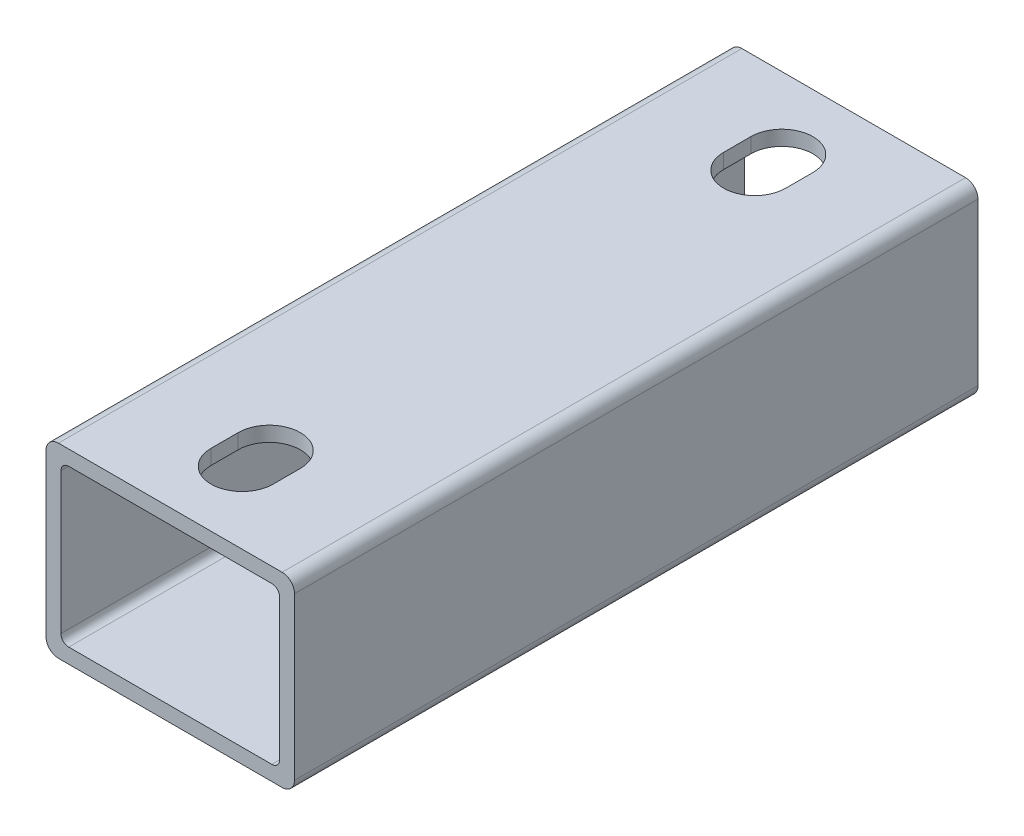
ISO-10303-21;
HEADER;
FILE_DESCRIPTION(('STEP AP214'),'2;1');
FILE_NAME('part.step','',(''),(''),'','','');
FILE_SCHEMA(('AUTOMOTIVE_DESIGN { 1 0 10303 214 1 1 1 1 }'));
ENDSEC;
DATA;
#1=APPLICATION_CONTEXT('core data for automotive mechanical design processes');
#2=APPLICATION_PROTOCOL_DEFINITION('international standard','automotive_design',2000,#1);
#3=PRODUCT_CONTEXT('',#1,'mechanical');
#4=PRODUCT('Part','Part','',(#3));
#5=PRODUCT_RELATED_PRODUCT_CATEGORY('part','',(#4));
#6=PRODUCT_DEFINITION_FORMATION('','',#4);
#7=PRODUCT_DEFINITION_CONTEXT('part definition',#1,'design');
#8=PRODUCT_DEFINITION('design','',#6,#7);
#9=PRODUCT_DEFINITION_SHAPE('','',#8);
#10=(LENGTH_UNIT() NAMED_UNIT(*) SI_UNIT(.MILLI.,.METRE.));
#11=(NAMED_UNIT(*) PLANE_ANGLE_UNIT() SI_UNIT($,.RADIAN.));
#12=(NAMED_UNIT(*) SI_UNIT($,.STERADIAN.) SOLID_ANGLE_UNIT());
#13=UNCERTAINTY_MEASURE_WITH_UNIT(LENGTH_MEASURE(1.E-05),#10,'distance_accuracy_value','');
#14=(GEOMETRIC_REPRESENTATION_CONTEXT(3) GLOBAL_UNCERTAINTY_ASSIGNED_CONTEXT((#13)) GLOBAL_UNIT_ASSIGNED_CONTEXT((#10,
#11,#12)) REPRESENTATION_CONTEXT('',''));
#15=CARTESIAN_POINT('',(0.,0.,0.));
#16=DIRECTION('',(0.,0.,1.));
#17=DIRECTION('',(1.,0.,0.));
#18=AXIS2_PLACEMENT_3D('',#15,#16,#17);
#19=CARTESIAN_POINT('',(22.86,-16.51,139.7));
#20=DIRECTION('',(0.,0.,1.));
#21=DIRECTION('',(1.,0.,0.));
#22=AXIS2_PLACEMENT_3D('',#19,#20,#21);
#23=PLANE('',#22);
#24=CARTESIAN_POINT('',(22.86,-16.51,139.7));
#25=DIRECTION('',(0.,0.,1.));
#26=DIRECTION('',(1.,0.,0.));
#27=AXIS2_PLACEMENT_3D('',#24,#25,#26);
#28=CIRCLE('',#27,2.53999999999999);
#29=CARTESIAN_POINT('',(22.86,-19.05,139.7));
#30=VERTEX_POINT('',#29);
#31=CARTESIAN_POINT('',(25.4,-16.51,139.7));
#32=VERTEX_POINT('',#31);
#33=EDGE_CURVE('E325',#30,#32,#28,.T.);
#34=ORIENTED_EDGE('',*,*,#33,.T.);
#35=DIRECTION('',(0.,1.,0.));
#36=VECTOR('',#35,1.);
#37=CARTESIAN_POINT('',(25.4,-16.51,139.7));
#38=LINE('',#37,#36);
#39=CARTESIAN_POINT('',(25.4,16.51,139.7));
#40=VERTEX_POINT('',#39);
#41=EDGE_CURVE('E328',#32,#40,#38,.T.);
#42=ORIENTED_EDGE('',*,*,#41,.T.);
#43=CARTESIAN_POINT('',(22.86,16.51,139.7));
#44=DIRECTION('',(0.,0.,1.));
#45=DIRECTION('',(1.,0.,0.));
#46=AXIS2_PLACEMENT_3D('',#43,#44,#45);
#47=CIRCLE('',#46,2.54);
#48=CARTESIAN_POINT('',(22.86,19.05,139.7));
#49=VERTEX_POINT('',#48);
#50=EDGE_CURVE('E331',#40,#49,#47,.T.);
#51=ORIENTED_EDGE('',*,*,#50,.T.);
#52=DIRECTION('',(-1.,0.,0.));
#53=VECTOR('',#52,1.);
#54=CARTESIAN_POINT('',(22.86,19.05,139.7));
#55=LINE('',#54,#53);
#56=CARTESIAN_POINT('',(-22.86,19.05,139.7));
#57=VERTEX_POINT('',#56);
#58=EDGE_CURVE('E333',#49,#57,#55,.T.);
#59=ORIENTED_EDGE('',*,*,#58,.T.);
#60=CARTESIAN_POINT('',(-22.86,16.51,139.7));
#61=DIRECTION('',(0.,0.,1.));
#62=DIRECTION('',(1.,0.,0.));
#63=AXIS2_PLACEMENT_3D('',#60,#61,#62);
#64=CIRCLE('',#63,2.54);
#65=CARTESIAN_POINT('',(-25.4,16.51,139.7));
#66=VERTEX_POINT('',#65);
#67=EDGE_CURVE('E335',#57,#66,#64,.T.);
#68=ORIENTED_EDGE('',*,*,#67,.T.);
#69=DIRECTION('',(0.,-1.,0.));
#70=VECTOR('',#69,1.);
#71=CARTESIAN_POINT('',(-25.4,-16.51,139.7));
#72=LINE('',#71,#70);
#73=CARTESIAN_POINT('',(-25.4,-16.51,139.7));
#74=VERTEX_POINT('',#73);
#75=EDGE_CURVE('E337',#66,#74,#72,.T.);
#76=ORIENTED_EDGE('',*,*,#75,.T.);
#77=CARTESIAN_POINT('',(-22.86,-16.51,139.7));
#78=DIRECTION('',(0.,0.,1.));
#79=DIRECTION('',(1.,0.,0.));
#80=AXIS2_PLACEMENT_3D('',#77,#78,#79);
#81=CIRCLE('',#80,2.54);
#82=CARTESIAN_POINT('',(-22.86,-19.05,139.7));
#83=VERTEX_POINT('',#82);
#84=EDGE_CURVE('E339',#74,#83,#81,.T.);
#85=ORIENTED_EDGE('',*,*,#84,.T.);
#86=DIRECTION('',(1.,0.,0.));
#87=VECTOR('',#86,1.);
#88=CARTESIAN_POINT('',(22.86,-19.05,139.7));
#89=LINE('',#88,#87);
#90=EDGE_CURVE('E341',#83,#30,#89,.T.);
#91=ORIENTED_EDGE('',*,*,#90,.T.);
#92=EDGE_LOOP('',(#34,#42,#51,#59,#68,#76,#85,#91));
#93=FACE_BOUND('',#92,.T.);
#94=DIRECTION('',(-1.,0.,0.));
#95=VECTOR('',#94,1.);
#96=CARTESIAN_POINT('',(20.7518,16.002,139.7));
#97=LINE('',#96,#95);
#98=CARTESIAN_POINT('',(20.7518,16.002,139.7));
#99=VERTEX_POINT('',#98);
#100=CARTESIAN_POINT('',(-20.7518,16.002,139.7));
#101=VERTEX_POINT('',#100);
#102=EDGE_CURVE('E268',#99,#101,#97,.T.);
#103=ORIENTED_EDGE('',*,*,#102,.F.);
#104=CARTESIAN_POINT('',(20.7518,14.4018,139.7));
#105=DIRECTION('',(0.,0.,1.));
#106=DIRECTION('',(1.,0.,0.));
#107=AXIS2_PLACEMENT_3D('',#104,#105,#106);
#108=CIRCLE('',#107,1.6002);
#109=CARTESIAN_POINT('',(22.352,14.4018,139.7));
#110=VERTEX_POINT('',#109);
#111=EDGE_CURVE('E266',#110,#99,#108,.T.);
#112=ORIENTED_EDGE('',*,*,#111,.F.);
#113=DIRECTION('',(0.,1.,0.));
#114=VECTOR('',#113,1.);
#115=CARTESIAN_POINT('',(22.352,14.4018,139.7));
#116=LINE('',#115,#114);
#117=CARTESIAN_POINT('',(22.352,-14.4018,139.7));
#118=VERTEX_POINT('',#117);
#119=EDGE_CURVE('E282',#118,#110,#116,.T.);
#120=ORIENTED_EDGE('',*,*,#119,.F.);
#121=CARTESIAN_POINT('',(20.7518,-14.4018,139.7));
#122=DIRECTION('',(0.,0.,1.));
#123=DIRECTION('',(1.,0.,0.));
#124=AXIS2_PLACEMENT_3D('',#121,#122,#123);
#125=CIRCLE('',#124,1.6002);
#126=CARTESIAN_POINT('',(20.7518,-16.002,139.7));
#127=VERTEX_POINT('',#126);
#128=EDGE_CURVE('E279',#127,#118,#125,.T.);
#129=ORIENTED_EDGE('',*,*,#128,.F.);
#130=DIRECTION('',(1.,0.,0.));
#131=VECTOR('',#130,1.);
#132=CARTESIAN_POINT('',(20.7518,-16.002,139.7));
#133=LINE('',#132,#131);
#134=CARTESIAN_POINT('',(-20.7518,-16.002,139.7));
#135=VERTEX_POINT('',#134);
#136=EDGE_CURVE('E277',#135,#127,#133,.T.);
#137=ORIENTED_EDGE('',*,*,#136,.F.);
#138=CARTESIAN_POINT('',(-20.7518,-14.4018,139.7));
#139=DIRECTION('',(0.,0.,1.));
#140=DIRECTION('',(1.,0.,0.));
#141=AXIS2_PLACEMENT_3D('',#138,#139,#140);
#142=CIRCLE('',#141,1.6002);
#143=CARTESIAN_POINT('',(-22.352,-14.4018,139.7));
#144=VERTEX_POINT('',#143);
#145=EDGE_CURVE('E275',#144,#135,#142,.T.);
#146=ORIENTED_EDGE('',*,*,#145,.F.);
#147=DIRECTION('',(0.,-1.,0.));
#148=VECTOR('',#147,1.);
#149=CARTESIAN_POINT('',(-22.352,14.4018,139.7));
#150=LINE('',#149,#148);
#151=CARTESIAN_POINT('',(-22.352,14.4018,139.7));
#152=VERTEX_POINT('',#151);
#153=EDGE_CURVE('E273',#152,#144,#150,.T.);
#154=ORIENTED_EDGE('',*,*,#153,.F.);
#155=CARTESIAN_POINT('',(-20.7518,14.4018,139.7));
#156=DIRECTION('',(0.,0.,1.));
#157=DIRECTION('',(1.,0.,0.));
#158=AXIS2_PLACEMENT_3D('',#155,#156,#157);
#159=CIRCLE('',#158,1.6002);
#160=EDGE_CURVE('E271',#101,#152,#159,.T.);
#161=ORIENTED_EDGE('',*,*,#160,.F.);
#162=EDGE_LOOP('',(#103,#112,#120,#129,#137,#146,#154,#161));
#163=FACE_BOUND('',#162,.T.);
#164=ADVANCED_FACE('F35',(#93,#163),#23,.T.);
#165=CARTESIAN_POINT('',(22.86,-16.51,0.));
#166=DIRECTION('',(0.,0.,1.));
#167=DIRECTION('',(1.,0.,0.));
#168=AXIS2_PLACEMENT_3D('',#165,#166,#167);
#169=PLANE('',#168);
#170=CARTESIAN_POINT('',(22.86,-16.51,0.));
#171=DIRECTION('',(0.,0.,1.));
#172=DIRECTION('',(1.,0.,0.));
#173=AXIS2_PLACEMENT_3D('',#170,#171,#172);
#174=CIRCLE('',#173,2.53999999999999);
#175=CARTESIAN_POINT('',(22.86,-19.05,0.));
#176=VERTEX_POINT('',#175);
#177=CARTESIAN_POINT('',(25.4,-16.51,0.));
#178=VERTEX_POINT('',#177);
#179=EDGE_CURVE('E324',#176,#178,#174,.T.);
#180=ORIENTED_EDGE('',*,*,#179,.F.);
#181=DIRECTION('',(1.,0.,0.));
#182=VECTOR('',#181,1.);
#183=CARTESIAN_POINT('',(22.86,-19.05,0.));
#184=LINE('',#183,#182);
#185=CARTESIAN_POINT('',(-22.86,-19.05,0.));
#186=VERTEX_POINT('',#185);
#187=EDGE_CURVE('E329',#186,#176,#184,.T.);
#188=ORIENTED_EDGE('',*,*,#187,.F.);
#189=CARTESIAN_POINT('',(-22.86,-16.51,0.));
#190=DIRECTION('',(0.,0.,1.));
#191=DIRECTION('',(1.,0.,0.));
#192=AXIS2_PLACEMENT_3D('',#189,#190,#191);
#193=CIRCLE('',#192,2.54);
#194=CARTESIAN_POINT('',(-25.4,-16.51,0.));
#195=VERTEX_POINT('',#194);
#196=EDGE_CURVE('E356',#195,#186,#193,.T.);
#197=ORIENTED_EDGE('',*,*,#196,.F.);
#198=DIRECTION('',(0.,-1.,0.));
#199=VECTOR('',#198,1.);
#200=CARTESIAN_POINT('',(-25.4,-16.51,0.));
#201=LINE('',#200,#199);
#202=CARTESIAN_POINT('',(-25.4,16.51,0.));
#203=VERTEX_POINT('',#202);
#204=EDGE_CURVE('E354',#203,#195,#201,.T.);
#205=ORIENTED_EDGE('',*,*,#204,.F.);
#206=CARTESIAN_POINT('',(-22.86,16.51,0.));
#207=DIRECTION('',(0.,0.,1.));
#208=DIRECTION('',(1.,0.,0.));
#209=AXIS2_PLACEMENT_3D('',#206,#207,#208);
#210=CIRCLE('',#209,2.54);
#211=CARTESIAN_POINT('',(-22.86,19.05,0.));
#212=VERTEX_POINT('',#211);
#213=EDGE_CURVE('E352',#212,#203,#210,.T.);
#214=ORIENTED_EDGE('',*,*,#213,.F.);
#215=DIRECTION('',(-1.,0.,0.));
#216=VECTOR('',#215,1.);
#217=CARTESIAN_POINT('',(22.86,19.05,0.));
#218=LINE('',#217,#216);
#219=CARTESIAN_POINT('',(22.86,19.05,0.));
#220=VERTEX_POINT('',#219);
#221=EDGE_CURVE('E350',#220,#212,#218,.T.);
#222=ORIENTED_EDGE('',*,*,#221,.F.);
#223=CARTESIAN_POINT('',(22.86,16.51,0.));
#224=DIRECTION('',(0.,0.,1.));
#225=DIRECTION('',(1.,0.,0.));
#226=AXIS2_PLACEMENT_3D('',#223,#224,#225);
#227=CIRCLE('',#226,2.54);
#228=CARTESIAN_POINT('',(25.4,16.51,0.));
#229=VERTEX_POINT('',#228);
#230=EDGE_CURVE('E348',#229,#220,#227,.T.);
#231=ORIENTED_EDGE('',*,*,#230,.F.);
#232=DIRECTION('',(0.,1.,0.));
#233=VECTOR('',#232,1.);
#234=CARTESIAN_POINT('',(25.4,-16.51,0.));
#235=LINE('',#234,#233);
#236=EDGE_CURVE('E346',#178,#229,#235,.T.);
#237=ORIENTED_EDGE('',*,*,#236,.F.);
#238=EDGE_LOOP('',(#180,#188,#197,#205,#214,#222,#231,#237));
#239=FACE_BOUND('',#238,.T.);
#240=CARTESIAN_POINT('',(20.7518,14.4018,0.));
#241=DIRECTION('',(0.,0.,1.));
#242=DIRECTION('',(1.,0.,0.));
#243=AXIS2_PLACEMENT_3D('',#240,#241,#242);
#244=CIRCLE('',#243,1.6002);
#245=CARTESIAN_POINT('',(22.352,14.4018,0.));
#246=VERTEX_POINT('',#245);
#247=CARTESIAN_POINT('',(20.7518,16.002,0.));
#248=VERTEX_POINT('',#247);
#249=EDGE_CURVE('E214',#246,#248,#244,.T.);
#250=ORIENTED_EDGE('',*,*,#249,.T.);
#251=DIRECTION('',(-1.,0.,0.));
#252=VECTOR('',#251,1.);
#253=CARTESIAN_POINT('',(20.7518,16.002,0.));
#254=LINE('',#253,#252);
#255=CARTESIAN_POINT('',(-20.7518,16.002,0.));
#256=VERTEX_POINT('',#255);
#257=EDGE_CURVE('E287',#248,#256,#254,.T.);
#258=ORIENTED_EDGE('',*,*,#257,.T.);
#259=CARTESIAN_POINT('',(-20.7518,14.4018,0.));
#260=DIRECTION('',(0.,0.,1.));
#261=DIRECTION('',(1.,0.,0.));
#262=AXIS2_PLACEMENT_3D('',#259,#260,#261);
#263=CIRCLE('',#262,1.6002);
#264=CARTESIAN_POINT('',(-22.352,14.4018,0.));
#265=VERTEX_POINT('',#264);
#266=EDGE_CURVE('E290',#256,#265,#263,.T.);
#267=ORIENTED_EDGE('',*,*,#266,.T.);
#268=DIRECTION('',(0.,-1.,0.));
#269=VECTOR('',#268,1.);
#270=CARTESIAN_POINT('',(-22.352,14.4018,0.));
#271=LINE('',#270,#269);
#272=CARTESIAN_POINT('',(-22.352,-14.4018,0.));
#273=VERTEX_POINT('',#272);
#274=EDGE_CURVE('E293',#265,#273,#271,.T.);
#275=ORIENTED_EDGE('',*,*,#274,.T.);
#276=CARTESIAN_POINT('',(-20.7518,-14.4018,0.));
#277=DIRECTION('',(0.,0.,1.));
#278=DIRECTION('',(1.,0.,0.));
#279=AXIS2_PLACEMENT_3D('',#276,#277,#278);
#280=CIRCLE('',#279,1.6002);
#281=CARTESIAN_POINT('',(-20.7518,-16.002,0.));
#282=VERTEX_POINT('',#281);
#283=EDGE_CURVE('E296',#273,#282,#280,.T.);
#284=ORIENTED_EDGE('',*,*,#283,.T.);
#285=DIRECTION('',(1.,0.,0.));
#286=VECTOR('',#285,1.);
#287=CARTESIAN_POINT('',(20.7518,-16.002,0.));
#288=LINE('',#287,#286);
#289=CARTESIAN_POINT('',(20.7518,-16.002,0.));
#290=VERTEX_POINT('',#289);
#291=EDGE_CURVE('E299',#282,#290,#288,.T.);
#292=ORIENTED_EDGE('',*,*,#291,.T.);
#293=CARTESIAN_POINT('',(20.7518,-14.4018,0.));
#294=DIRECTION('',(0.,0.,1.));
#295=DIRECTION('',(1.,0.,0.));
#296=AXIS2_PLACEMENT_3D('',#293,#294,#295);
#297=CIRCLE('',#296,1.6002);
#298=CARTESIAN_POINT('',(22.352,-14.4018,0.));
#299=VERTEX_POINT('',#298);
#300=EDGE_CURVE('E302',#290,#299,#297,.T.);
#301=ORIENTED_EDGE('',*,*,#300,.T.);
#302=DIRECTION('',(0.,1.,0.));
#303=VECTOR('',#302,1.);
#304=CARTESIAN_POINT('',(22.352,14.4018,0.));
#305=LINE('',#304,#303);
#306=EDGE_CURVE('E269',#299,#246,#305,.T.);
#307=ORIENTED_EDGE('',*,*,#306,.T.);
#308=EDGE_LOOP('',(#250,#258,#267,#275,#284,#292,#301,#307));
#309=FACE_BOUND('',#308,.T.);
#310=ADVANCED_FACE('F386',(#239,#309),#169,.F.);
#311=CARTESIAN_POINT('',(22.86,-16.51,139.7));
#312=DIRECTION('',(0.,0.,-1.));
#313=DIRECTION('',(-1.,0.,0.));
#314=AXIS2_PLACEMENT_3D('',#311,#312,#313);
#315=CYLINDRICAL_SURFACE('',#314,2.53999999999999);
#316=ORIENTED_EDGE('',*,*,#179,.T.);
#317=DIRECTION('',(0.,0.,-1.));
#318=VECTOR('',#317,1.);
#319=CARTESIAN_POINT('',(25.4,-16.51,139.7));
#320=LINE('',#319,#318);
#321=EDGE_CURVE('E11',#32,#178,#320,.T.);
#322=ORIENTED_EDGE('',*,*,#321,.F.);
#323=ORIENTED_EDGE('',*,*,#33,.F.);
#324=DIRECTION('',(0.,0.,-1.));
#325=VECTOR('',#324,1.);
#326=CARTESIAN_POINT('',(22.86,-19.05,139.7));
#327=LINE('',#326,#325);
#328=EDGE_CURVE('E343',#30,#176,#327,.T.);
#329=ORIENTED_EDGE('',*,*,#328,.T.);
#330=EDGE_LOOP('',(#316,#322,#323,#329));
#331=FACE_BOUND('',#330,.T.);
#332=ADVANCED_FACE('F37',(#331),#315,.T.);
#333=CARTESIAN_POINT('',(25.4,-16.51,139.7));
#334=DIRECTION('',(-1.,0.,0.));
#335=DIRECTION('',(0.,0.,1.));
#336=AXIS2_PLACEMENT_3D('',#333,#334,#335);
#337=PLANE('',#336);
#338=ORIENTED_EDGE('',*,*,#236,.T.);
#339=DIRECTION('',(0.,0.,-1.));
#340=VECTOR('',#339,1.);
#341=CARTESIAN_POINT('',(25.4,16.51,139.7));
#342=LINE('',#341,#340);
#343=EDGE_CURVE('E43',#40,#229,#342,.T.);
#344=ORIENTED_EDGE('',*,*,#343,.F.);
#345=ORIENTED_EDGE('',*,*,#41,.F.);
#346=ORIENTED_EDGE('',*,*,#321,.T.);
#347=EDGE_LOOP('',(#338,#344,#345,#346));
#348=FACE_BOUND('',#347,.T.);
#349=ADVANCED_FACE('F403',(#348),#337,.F.);
#350=CARTESIAN_POINT('',(22.86,16.51,139.7));
#351=DIRECTION('',(0.,0.,-1.));
#352=DIRECTION('',(-1.,0.,0.));
#353=AXIS2_PLACEMENT_3D('',#350,#351,#352);
#354=CYLINDRICAL_SURFACE('',#353,2.54);
#355=ORIENTED_EDGE('',*,*,#230,.T.);
#356=DIRECTION('',(0.,0.,-1.));
#357=VECTOR('',#356,1.);
#358=CARTESIAN_POINT('',(22.86,19.05,139.7));
#359=LINE('',#358,#357);
#360=EDGE_CURVE('E373',#49,#220,#359,.T.);
#361=ORIENTED_EDGE('',*,*,#360,.F.);
#362=ORIENTED_EDGE('',*,*,#50,.F.);
#363=ORIENTED_EDGE('',*,*,#343,.T.);
#364=EDGE_LOOP('',(#355,#361,#362,#363));
#365=FACE_BOUND('',#364,.T.);
#366=ADVANCED_FACE('F380',(#365),#354,.T.);
#367=CARTESIAN_POINT('',(22.86,19.05,139.7));
#368=DIRECTION('',(0.,-1.,0.));
#369=DIRECTION('',(0.,0.,-1.));
#370=AXIS2_PLACEMENT_3D('',#367,#368,#369);
#371=PLANE('',#370);
#372=DIRECTION('',(0.,0.,1.));
#373=VECTOR('',#372,1.);
#374=CARTESIAN_POINT('',(-6.35000000000006,19.05,20.2406250000001));
#375=LINE('',#374,#373);
#376=CARTESIAN_POINT('',(-6.35000000000006,19.05,14.6843750000001));
#377=VERTEX_POINT('',#376);
#378=CARTESIAN_POINT('',(-6.35,19.05,20.2406250000001));
#379=VERTEX_POINT('',#378);
#380=EDGE_CURVE('E221',#377,#379,#375,.T.);
#381=ORIENTED_EDGE('',*,*,#380,.F.);
#382=CARTESIAN_POINT('',(0.,19.05,14.6843750000001));
#383=DIRECTION('',(0.,1.,0.));
#384=DIRECTION('',(0.,0.,1.));
#385=AXIS2_PLACEMENT_3D('',#382,#383,#384);
#386=CIRCLE('',#385,6.35000000000007);
#387=CARTESIAN_POINT('',(6.35000000000009,19.05,14.6843750000001));
#388=VERTEX_POINT('',#387);
#389=EDGE_CURVE('E50',#388,#377,#386,.T.);
#390=ORIENTED_EDGE('',*,*,#389,.F.);
#391=DIRECTION('',(0.,0.,-1.));
#392=VECTOR('',#391,1.);
#393=CARTESIAN_POINT('',(6.35000000000009,19.05,14.6843750000001));
#394=LINE('',#393,#392);
#395=CARTESIAN_POINT('',(6.35000000000004,19.05,20.2406250000001));
#396=VERTEX_POINT('',#395);
#397=EDGE_CURVE('E207',#396,#388,#394,.T.);
#398=ORIENTED_EDGE('',*,*,#397,.F.);
#399=CARTESIAN_POINT('',(0.,19.05,20.2406250000001));
#400=DIRECTION('',(0.,1.,0.));
#401=DIRECTION('',(0.,0.,1.));
#402=AXIS2_PLACEMENT_3D('',#399,#400,#401);
#403=CIRCLE('',#402,6.35000000000005);
#404=EDGE_CURVE('E215',#379,#396,#403,.T.);
#405=ORIENTED_EDGE('',*,*,#404,.F.);
#406=EDGE_LOOP('',(#381,#390,#398,#405));
#407=FACE_BOUND('',#406,.T.);
#408=DIRECTION('',(0.,0.,-1.));
#409=VECTOR('',#408,1.);
#410=CARTESIAN_POINT('',(6.3500000000001,19.05,119.459375));
#411=LINE('',#410,#409);
#412=CARTESIAN_POINT('',(6.35000000000005,19.05,125.015625));
#413=VERTEX_POINT('',#412);
#414=CARTESIAN_POINT('',(6.35000000000013,19.05,119.459375));
#415=VERTEX_POINT('',#414);
#416=EDGE_CURVE('E247',#413,#415,#411,.T.);
#417=ORIENTED_EDGE('',*,*,#416,.F.);
#418=CARTESIAN_POINT('',(0.,19.05,125.015625));
#419=DIRECTION('',(0.,1.,0.));
#420=DIRECTION('',(0.,0.,1.));
#421=AXIS2_PLACEMENT_3D('',#418,#419,#420);
#422=CIRCLE('',#421,6.35000000000005);
#423=CARTESIAN_POINT('',(-6.35000000000004,19.05,125.015625));
#424=VERTEX_POINT('',#423);
#425=EDGE_CURVE('E58',#424,#413,#422,.T.);
#426=ORIENTED_EDGE('',*,*,#425,.F.);
#427=DIRECTION('',(0.,0.,1.));
#428=VECTOR('',#427,1.);
#429=CARTESIAN_POINT('',(-6.35000000000004,19.05,125.015625));
#430=LINE('',#429,#428);
#431=CARTESIAN_POINT('',(-6.35000000000004,19.05,119.459375));
#432=VERTEX_POINT('',#431);
#433=EDGE_CURVE('E231',#432,#424,#430,.T.);
#434=ORIENTED_EDGE('',*,*,#433,.F.);
#435=CARTESIAN_POINT('',(0.,19.05,119.459375));
#436=DIRECTION('',(0.,1.,0.));
#437=DIRECTION('',(0.,0.,1.));
#438=AXIS2_PLACEMENT_3D('',#435,#436,#437);
#439=CIRCLE('',#438,6.35000000000007);
#440=EDGE_CURVE('E244',#415,#432,#439,.T.);
#441=ORIENTED_EDGE('',*,*,#440,.F.);
#442=EDGE_LOOP('',(#417,#426,#434,#441));
#443=FACE_BOUND('',#442,.T.);
#444=ORIENTED_EDGE('',*,*,#221,.T.);
#445=DIRECTION('',(0.,0.,-1.));
#446=VECTOR('',#445,1.);
#447=CARTESIAN_POINT('',(-22.86,19.05,139.7));
#448=LINE('',#447,#446);
#449=EDGE_CURVE('E370',#57,#212,#448,.T.);
#450=ORIENTED_EDGE('',*,*,#449,.F.);
#451=ORIENTED_EDGE('',*,*,#58,.F.);
#452=ORIENTED_EDGE('',*,*,#360,.T.);
#453=EDGE_LOOP('',(#444,#450,#451,#452));
#454=FACE_BOUND('',#453,.T.);
#455=ADVANCED_FACE('F218',(#407,#443,#454),#371,.F.);
#456=CARTESIAN_POINT('',(-22.86,16.51,139.7));
#457=DIRECTION('',(0.,0.,-1.));
#458=DIRECTION('',(-1.,0.,0.));
#459=AXIS2_PLACEMENT_3D('',#456,#457,#458);
#460=CYLINDRICAL_SURFACE('',#459,2.54);
#461=ORIENTED_EDGE('',*,*,#213,.T.);
#462=DIRECTION('',(0.,0.,-1.));
#463=VECTOR('',#462,1.);
#464=CARTESIAN_POINT('',(-25.4,16.51,139.7));
#465=LINE('',#464,#463);
#466=EDGE_CURVE('E367',#66,#203,#465,.T.);
#467=ORIENTED_EDGE('',*,*,#466,.F.);
#468=ORIENTED_EDGE('',*,*,#67,.F.);
#469=ORIENTED_EDGE('',*,*,#449,.T.);
#470=EDGE_LOOP('',(#461,#467,#468,#469));
#471=FACE_BOUND('',#470,.T.);
#472=ADVANCED_FACE('F395',(#471),#460,.T.);
#473=CARTESIAN_POINT('',(-25.4,-16.51,139.7));
#474=DIRECTION('',(1.,0.,0.));
#475=DIRECTION('',(0.,1.,0.));
#476=AXIS2_PLACEMENT_3D('',#473,#474,#475);
#477=PLANE('',#476);
#478=ORIENTED_EDGE('',*,*,#204,.T.);
#479=DIRECTION('',(0.,0.,-1.));
#480=VECTOR('',#479,1.);
#481=CARTESIAN_POINT('',(-25.4,-16.51,139.7));
#482=LINE('',#481,#480);
#483=EDGE_CURVE('E364',#74,#195,#482,.T.);
#484=ORIENTED_EDGE('',*,*,#483,.F.);
#485=ORIENTED_EDGE('',*,*,#75,.F.);
#486=ORIENTED_EDGE('',*,*,#466,.T.);
#487=EDGE_LOOP('',(#478,#484,#485,#486));
#488=FACE_BOUND('',#487,.T.);
#489=ADVANCED_FACE('F416',(#488),#477,.F.);
#490=CARTESIAN_POINT('',(-22.86,-16.51,139.7));
#491=DIRECTION('',(0.,0.,-1.));
#492=DIRECTION('',(-1.,0.,0.));
#493=AXIS2_PLACEMENT_3D('',#490,#491,#492);
#494=CYLINDRICAL_SURFACE('',#493,2.54);
#495=ORIENTED_EDGE('',*,*,#196,.T.);
#496=DIRECTION('',(0.,0.,-1.));
#497=VECTOR('',#496,1.);
#498=CARTESIAN_POINT('',(-22.86,-19.05,139.7));
#499=LINE('',#498,#497);
#500=EDGE_CURVE('E361',#83,#186,#499,.T.);
#501=ORIENTED_EDGE('',*,*,#500,.F.);
#502=ORIENTED_EDGE('',*,*,#84,.F.);
#503=ORIENTED_EDGE('',*,*,#483,.T.);
#504=EDGE_LOOP('',(#495,#501,#502,#503));
#505=FACE_BOUND('',#504,.T.);
#506=ADVANCED_FACE('F414',(#505),#494,.T.);
#507=CARTESIAN_POINT('',(22.86,-19.05,139.7));
#508=DIRECTION('',(0.,1.,0.));
#509=DIRECTION('',(-1.,0.,0.));
#510=AXIS2_PLACEMENT_3D('',#507,#508,#509);
#511=PLANE('',#510);
#512=ORIENTED_EDGE('',*,*,#187,.T.);
#513=ORIENTED_EDGE('',*,*,#328,.F.);
#514=ORIENTED_EDGE('',*,*,#90,.F.);
#515=ORIENTED_EDGE('',*,*,#500,.T.);
#516=EDGE_LOOP('',(#512,#513,#514,#515));
#517=FACE_BOUND('',#516,.T.);
#518=ADVANCED_FACE('F409',(#517),#511,.F.);
#519=CARTESIAN_POINT('',(20.7518,14.4018,139.7));
#520=DIRECTION('',(0.,0.,-1.));
#521=DIRECTION('',(-1.,0.,0.));
#522=AXIS2_PLACEMENT_3D('',#519,#520,#521);
#523=CYLINDRICAL_SURFACE('',#522,1.6002);
#524=ORIENTED_EDGE('',*,*,#249,.F.);
#525=DIRECTION('',(0.,0.,-1.));
#526=VECTOR('',#525,1.);
#527=CARTESIAN_POINT('',(22.352,14.4018,139.7));
#528=LINE('',#527,#526);
#529=EDGE_CURVE('E284',#110,#246,#528,.T.);
#530=ORIENTED_EDGE('',*,*,#529,.F.);
#531=ORIENTED_EDGE('',*,*,#111,.T.);
#532=DIRECTION('',(0.,0.,-1.));
#533=VECTOR('',#532,1.);
#534=CARTESIAN_POINT('',(20.7518,16.002,139.7));
#535=LINE('',#534,#533);
#536=EDGE_CURVE('E321',#99,#248,#535,.T.);
#537=ORIENTED_EDGE('',*,*,#536,.T.);
#538=EDGE_LOOP('',(#524,#530,#531,#537));
#539=FACE_BOUND('',#538,.T.);
#540=ADVANCED_FACE('F432',(#539),#523,.F.);
#541=CARTESIAN_POINT('',(20.7518,16.002,139.7));
#542=DIRECTION('',(0.,-1.,0.));
#543=DIRECTION('',(1.,0.,0.));
#544=AXIS2_PLACEMENT_3D('',#541,#542,#543);
#545=PLANE('',#544);
#546=CARTESIAN_POINT('',(0.,16.002,14.6843750000001));
#547=DIRECTION('',(0.,-1.,0.));
#548=DIRECTION('',(1.,0.,0.));
#549=AXIS2_PLACEMENT_3D('',#546,#547,#548);
#550=CIRCLE('',#549,6.35000000000007);
#551=CARTESIAN_POINT('',(6.35000000000009,16.002,14.6843750000001));
#552=VERTEX_POINT('',#551);
#553=CARTESIAN_POINT('',(-6.35000000000006,16.002,14.6843750000001));
#554=VERTEX_POINT('',#553);
#555=EDGE_CURVE('E200',#552,#554,#550,.F.);
#556=ORIENTED_EDGE('',*,*,#555,.T.);
#557=DIRECTION('',(0.,0.,1.));
#558=VECTOR('',#557,1.);
#559=CARTESIAN_POINT('',(-6.35000000000006,16.002,20.2406250000001));
#560=LINE('',#559,#558);
#561=CARTESIAN_POINT('',(-6.35000000000006,16.002,20.2406250000001));
#562=VERTEX_POINT('',#561);
#563=EDGE_CURVE('E225',#554,#562,#560,.T.);
#564=ORIENTED_EDGE('',*,*,#563,.T.);
#565=CARTESIAN_POINT('',(0.,16.002,20.2406250000001));
#566=DIRECTION('',(0.,-1.,0.));
#567=DIRECTION('',(1.,0.,0.));
#568=AXIS2_PLACEMENT_3D('',#565,#566,#567);
#569=CIRCLE('',#568,6.35000000000005);
#570=CARTESIAN_POINT('',(6.35000000000009,16.002,20.2406250000001));
#571=VERTEX_POINT('',#570);
#572=EDGE_CURVE('E203',#562,#571,#569,.F.);
#573=ORIENTED_EDGE('',*,*,#572,.T.);
#574=DIRECTION('',(0.,0.,-1.));
#575=VECTOR('',#574,1.);
#576=CARTESIAN_POINT('',(6.35000000000009,16.002,14.6843750000001));
#577=LINE('',#576,#575);
#578=EDGE_CURVE('E204',#571,#552,#577,.T.);
#579=ORIENTED_EDGE('',*,*,#578,.T.);
#580=EDGE_LOOP('',(#556,#564,#573,#579));
#581=FACE_BOUND('',#580,.T.);
#582=CARTESIAN_POINT('',(0.,16.002,125.015625));
#583=DIRECTION('',(0.,-1.,0.));
#584=DIRECTION('',(1.,0.,0.));
#585=AXIS2_PLACEMENT_3D('',#582,#583,#584);
#586=CIRCLE('',#585,6.35000000000005);
#587=CARTESIAN_POINT('',(-6.35000000000004,16.002,125.015625));
#588=VERTEX_POINT('',#587);
#589=CARTESIAN_POINT('',(6.35000000000005,16.002,125.015625));
#590=VERTEX_POINT('',#589);
#591=EDGE_CURVE('E251',#588,#590,#586,.F.);
#592=ORIENTED_EDGE('',*,*,#591,.T.);
#593=DIRECTION('',(0.,0.,-1.));
#594=VECTOR('',#593,1.);
#595=CARTESIAN_POINT('',(6.3500000000001,16.002,119.459375));
#596=LINE('',#595,#594);
#597=CARTESIAN_POINT('',(6.3500000000001,16.002,119.459375));
#598=VERTEX_POINT('',#597);
#599=EDGE_CURVE('E237',#590,#598,#596,.T.);
#600=ORIENTED_EDGE('',*,*,#599,.T.);
#601=CARTESIAN_POINT('',(0.,16.002,119.459375));
#602=DIRECTION('',(0.,-1.,0.));
#603=DIRECTION('',(1.,0.,0.));
#604=AXIS2_PLACEMENT_3D('',#601,#602,#603);
#605=CIRCLE('',#604,6.35000000000007);
#606=CARTESIAN_POINT('',(-6.35000000000002,16.002,119.459375));
#607=VERTEX_POINT('',#606);
#608=EDGE_CURVE('E259',#598,#607,#605,.F.);
#609=ORIENTED_EDGE('',*,*,#608,.T.);
#610=DIRECTION('',(0.,0.,1.));
#611=VECTOR('',#610,1.);
#612=CARTESIAN_POINT('',(-6.35000000000004,16.002,125.015625));
#613=LINE('',#612,#611);
#614=EDGE_CURVE('E255',#607,#588,#613,.T.);
#615=ORIENTED_EDGE('',*,*,#614,.T.);
#616=EDGE_LOOP('',(#592,#600,#609,#615));
#617=FACE_BOUND('',#616,.T.);
#618=ORIENTED_EDGE('',*,*,#257,.F.);
#619=ORIENTED_EDGE('',*,*,#536,.F.);
#620=ORIENTED_EDGE('',*,*,#102,.T.);
#621=DIRECTION('',(0.,0.,-1.));
#622=VECTOR('',#621,1.);
#623=CARTESIAN_POINT('',(-20.7518,16.002,139.7));
#624=LINE('',#623,#622);
#625=EDGE_CURVE('E319',#101,#256,#624,.T.);
#626=ORIENTED_EDGE('',*,*,#625,.T.);
#627=EDGE_LOOP('',(#618,#619,#620,#626));
#628=FACE_BOUND('',#627,.T.);
#629=ADVANCED_FACE('F439',(#581,#617,#628),#545,.T.);
#630=CARTESIAN_POINT('',(-20.7518,14.4018,139.7));
#631=DIRECTION('',(0.,0.,-1.));
#632=DIRECTION('',(-1.,0.,0.));
#633=AXIS2_PLACEMENT_3D('',#630,#631,#632);
#634=CYLINDRICAL_SURFACE('',#633,1.6002);
#635=ORIENTED_EDGE('',*,*,#266,.F.);
#636=ORIENTED_EDGE('',*,*,#625,.F.);
#637=ORIENTED_EDGE('',*,*,#160,.T.);
#638=DIRECTION('',(0.,0.,-1.));
#639=VECTOR('',#638,1.);
#640=CARTESIAN_POINT('',(-22.352,14.4018,139.7));
#641=LINE('',#640,#639);
#642=EDGE_CURVE('E317',#152,#265,#641,.T.);
#643=ORIENTED_EDGE('',*,*,#642,.T.);
#644=EDGE_LOOP('',(#635,#636,#637,#643));
#645=FACE_BOUND('',#644,.T.);
#646=ADVANCED_FACE('F445',(#645),#634,.F.);
#647=CARTESIAN_POINT('',(-22.352,14.4018,139.7));
#648=DIRECTION('',(1.,0.,0.));
#649=DIRECTION('',(0.,1.,0.));
#650=AXIS2_PLACEMENT_3D('',#647,#648,#649);
#651=PLANE('',#650);
#652=ORIENTED_EDGE('',*,*,#274,.F.);
#653=ORIENTED_EDGE('',*,*,#642,.F.);
#654=ORIENTED_EDGE('',*,*,#153,.T.);
#655=DIRECTION('',(0.,0.,-1.));
#656=VECTOR('',#655,1.);
#657=CARTESIAN_POINT('',(-22.352,-14.4018,139.7));
#658=LINE('',#657,#656);
#659=EDGE_CURVE('E315',#144,#273,#658,.T.);
#660=ORIENTED_EDGE('',*,*,#659,.T.);
#661=EDGE_LOOP('',(#652,#653,#654,#660));
#662=FACE_BOUND('',#661,.T.);
#663=ADVANCED_FACE('F471',(#662),#651,.T.);
#664=CARTESIAN_POINT('',(-20.7518,-14.4018,139.7));
#665=DIRECTION('',(0.,0.,-1.));
#666=DIRECTION('',(-1.,0.,0.));
#667=AXIS2_PLACEMENT_3D('',#664,#665,#666);
#668=CYLINDRICAL_SURFACE('',#667,1.6002);
#669=ORIENTED_EDGE('',*,*,#283,.F.);
#670=ORIENTED_EDGE('',*,*,#659,.F.);
#671=ORIENTED_EDGE('',*,*,#145,.T.);
#672=DIRECTION('',(0.,0.,-1.));
#673=VECTOR('',#672,1.);
#674=CARTESIAN_POINT('',(-20.7518,-16.002,139.7));
#675=LINE('',#674,#673);
#676=EDGE_CURVE('E313',#135,#282,#675,.T.);
#677=ORIENTED_EDGE('',*,*,#676,.T.);
#678=EDGE_LOOP('',(#669,#670,#671,#677));
#679=FACE_BOUND('',#678,.T.);
#680=ADVANCED_FACE('F476',(#679),#668,.F.);
#681=CARTESIAN_POINT('',(20.7518,-16.002,139.7));
#682=DIRECTION('',(0.,1.,0.));
#683=DIRECTION('',(-1.,0.,0.));
#684=AXIS2_PLACEMENT_3D('',#681,#682,#683);
#685=PLANE('',#684);
#686=ORIENTED_EDGE('',*,*,#291,.F.);
#687=ORIENTED_EDGE('',*,*,#676,.F.);
#688=ORIENTED_EDGE('',*,*,#136,.T.);
#689=DIRECTION('',(0.,0.,-1.));
#690=VECTOR('',#689,1.);
#691=CARTESIAN_POINT('',(20.7518,-16.002,139.7));
#692=LINE('',#691,#690);
#693=EDGE_CURVE('E311',#127,#290,#692,.T.);
#694=ORIENTED_EDGE('',*,*,#693,.T.);
#695=EDGE_LOOP('',(#686,#687,#688,#694));
#696=FACE_BOUND('',#695,.T.);
#697=ADVANCED_FACE('F479',(#696),#685,.T.);
#698=CARTESIAN_POINT('',(20.7518,-14.4018,139.7));
#699=DIRECTION('',(0.,0.,-1.));
#700=DIRECTION('',(-1.,0.,0.));
#701=AXIS2_PLACEMENT_3D('',#698,#699,#700);
#702=CYLINDRICAL_SURFACE('',#701,1.6002);
#703=ORIENTED_EDGE('',*,*,#300,.F.);
#704=ORIENTED_EDGE('',*,*,#693,.F.);
#705=ORIENTED_EDGE('',*,*,#128,.T.);
#706=DIRECTION('',(0.,0.,-1.));
#707=VECTOR('',#706,1.);
#708=CARTESIAN_POINT('',(22.352,-14.4018,139.7));
#709=LINE('',#708,#707);
#710=EDGE_CURVE('E309',#118,#299,#709,.T.);
#711=ORIENTED_EDGE('',*,*,#710,.T.);
#712=EDGE_LOOP('',(#703,#704,#705,#711));
#713=FACE_BOUND('',#712,.T.);
#714=ADVANCED_FACE('F458',(#713),#702,.F.);
#715=CARTESIAN_POINT('',(22.352,14.4018,139.7));
#716=DIRECTION('',(-1.,0.,0.));
#717=DIRECTION('',(0.,-1.,0.));
#718=AXIS2_PLACEMENT_3D('',#715,#716,#717);
#719=PLANE('',#718);
#720=ORIENTED_EDGE('',*,*,#306,.F.);
#721=ORIENTED_EDGE('',*,*,#710,.F.);
#722=ORIENTED_EDGE('',*,*,#119,.T.);
#723=ORIENTED_EDGE('',*,*,#529,.T.);
#724=EDGE_LOOP('',(#720,#721,#722,#723));
#725=FACE_BOUND('',#724,.T.);
#726=ADVANCED_FACE('F452',(#725),#719,.T.);
#727=CARTESIAN_POINT('',(0.,-19.051,125.015625));
#728=DIRECTION('',(0.,1.,0.));
#729=DIRECTION('',(-1.,0.,0.));
#730=AXIS2_PLACEMENT_3D('',#727,#728,#729);
#731=CYLINDRICAL_SURFACE('',#730,6.35000000000005);
#732=DIRECTION('',(0.,1.,0.));
#733=VECTOR('',#732,1.);
#734=CARTESIAN_POINT('',(-6.35000000000004,-19.051,125.015625));
#735=LINE('',#734,#733);
#736=EDGE_CURVE('E258',#588,#424,#735,.T.);
#737=ORIENTED_EDGE('',*,*,#736,.T.);
#738=ORIENTED_EDGE('',*,*,#425,.T.);
#739=DIRECTION('',(0.,1.,0.));
#740=VECTOR('',#739,1.);
#741=CARTESIAN_POINT('',(6.35000000000006,-19.051,125.015625));
#742=LINE('',#741,#740);
#743=EDGE_CURVE('E254',#590,#413,#742,.T.);
#744=ORIENTED_EDGE('',*,*,#743,.F.);
#745=ORIENTED_EDGE('',*,*,#591,.F.);
#746=EDGE_LOOP('',(#737,#738,#744,#745));
#747=FACE_BOUND('',#746,.T.);
#748=ADVANCED_FACE('F524',(#747),#731,.F.);
#749=CARTESIAN_POINT('',(-6.35000000000004,-19.051,125.015625));
#750=DIRECTION('',(-1.,0.,0.));
#751=DIRECTION('',(0.,-1.,0.));
#752=AXIS2_PLACEMENT_3D('',#749,#750,#751);
#753=PLANE('',#752);
#754=DIRECTION('',(0.,1.,0.));
#755=VECTOR('',#754,1.);
#756=CARTESIAN_POINT('',(-6.35000000000004,-19.051,119.459375));
#757=LINE('',#756,#755);
#758=EDGE_CURVE('E241',#607,#432,#757,.T.);
#759=ORIENTED_EDGE('',*,*,#758,.T.);
#760=ORIENTED_EDGE('',*,*,#433,.T.);
#761=ORIENTED_EDGE('',*,*,#736,.F.);
#762=ORIENTED_EDGE('',*,*,#614,.F.);
#763=EDGE_LOOP('',(#759,#760,#761,#762));
#764=FACE_BOUND('',#763,.T.);
#765=ADVANCED_FACE('F540',(#764),#753,.F.);
#766=CARTESIAN_POINT('',(0.,-19.051,119.459375));
#767=DIRECTION('',(0.,1.,0.));
#768=DIRECTION('',(-1.,0.,0.));
#769=AXIS2_PLACEMENT_3D('',#766,#767,#768);
#770=CYLINDRICAL_SURFACE('',#769,6.35000000000007);
#771=DIRECTION('',(0.,1.,0.));
#772=VECTOR('',#771,1.);
#773=CARTESIAN_POINT('',(6.35000000000013,-19.051,119.459375));
#774=LINE('',#773,#772);
#775=EDGE_CURVE('E240',#598,#415,#774,.T.);
#776=ORIENTED_EDGE('',*,*,#775,.T.);
#777=ORIENTED_EDGE('',*,*,#440,.T.);
#778=ORIENTED_EDGE('',*,*,#758,.F.);
#779=ORIENTED_EDGE('',*,*,#608,.F.);
#780=EDGE_LOOP('',(#776,#777,#778,#779));
#781=FACE_BOUND('',#780,.T.);
#782=ADVANCED_FACE('F549',(#781),#770,.F.);
#783=CARTESIAN_POINT('',(6.35000000000011,-19.051,119.459375));
#784=DIRECTION('',(1.,0.,0.));
#785=DIRECTION('',(0.,0.,-1.));
#786=AXIS2_PLACEMENT_3D('',#783,#784,#785);
#787=PLANE('',#786);
#788=ORIENTED_EDGE('',*,*,#743,.T.);
#789=ORIENTED_EDGE('',*,*,#416,.T.);
#790=ORIENTED_EDGE('',*,*,#775,.F.);
#791=ORIENTED_EDGE('',*,*,#599,.F.);
#792=EDGE_LOOP('',(#788,#789,#790,#791));
#793=FACE_BOUND('',#792,.T.);
#794=ADVANCED_FACE('F559',(#793),#787,.F.);
#795=CARTESIAN_POINT('',(0.,-19.051,14.6843750000001));
#796=DIRECTION('',(0.,1.,0.));
#797=DIRECTION('',(-1.,0.,0.));
#798=AXIS2_PLACEMENT_3D('',#795,#796,#797);
#799=CYLINDRICAL_SURFACE('',#798,6.35000000000007);
#800=DIRECTION('',(0.,1.,0.));
#801=VECTOR('',#800,1.);
#802=CARTESIAN_POINT('',(6.3500000000001,-19.051,14.6843750000001));
#803=LINE('',#802,#801);
#804=EDGE_CURVE('E196',#552,#388,#803,.T.);
#805=ORIENTED_EDGE('',*,*,#804,.T.);
#806=ORIENTED_EDGE('',*,*,#389,.T.);
#807=DIRECTION('',(0.,1.,0.));
#808=VECTOR('',#807,1.);
#809=CARTESIAN_POINT('',(-6.35000000000005,-19.051,14.6843750000001));
#810=LINE('',#809,#808);
#811=EDGE_CURVE('E230',#554,#377,#810,.T.);
#812=ORIENTED_EDGE('',*,*,#811,.F.);
#813=ORIENTED_EDGE('',*,*,#555,.F.);
#814=EDGE_LOOP('',(#805,#806,#812,#813));
#815=FACE_BOUND('',#814,.T.);
#816=ADVANCED_FACE('F198',(#815),#799,.F.);
#817=CARTESIAN_POINT('',(6.3500000000001,-19.051,14.6843750000001));
#818=DIRECTION('',(1.,0.,0.));
#819=DIRECTION('',(0.,0.,-1.));
#820=AXIS2_PLACEMENT_3D('',#817,#818,#819);
#821=PLANE('',#820);
#822=DIRECTION('',(0.,1.,0.));
#823=VECTOR('',#822,1.);
#824=CARTESIAN_POINT('',(6.35000000000005,-19.051,20.2406250000001));
#825=LINE('',#824,#823);
#826=EDGE_CURVE('E210',#571,#396,#825,.T.);
#827=ORIENTED_EDGE('',*,*,#826,.T.);
#828=ORIENTED_EDGE('',*,*,#397,.T.);
#829=ORIENTED_EDGE('',*,*,#804,.F.);
#830=ORIENTED_EDGE('',*,*,#578,.F.);
#831=EDGE_LOOP('',(#827,#828,#829,#830));
#832=FACE_BOUND('',#831,.T.);
#833=ADVANCED_FACE('F208',(#832),#821,.F.);
#834=CARTESIAN_POINT('',(0.,-19.051,20.2406250000001));
#835=DIRECTION('',(0.,1.,0.));
#836=DIRECTION('',(-1.,0.,0.));
#837=AXIS2_PLACEMENT_3D('',#834,#835,#836);
#838=CYLINDRICAL_SURFACE('',#837,6.35000000000005);
#839=DIRECTION('',(0.,1.,0.));
#840=VECTOR('',#839,1.);
#841=CARTESIAN_POINT('',(-6.35,-19.051,20.2406250000001));
#842=LINE('',#841,#840);
#843=EDGE_CURVE('E222',#562,#379,#842,.T.);
#844=ORIENTED_EDGE('',*,*,#843,.T.);
#845=ORIENTED_EDGE('',*,*,#404,.T.);
#846=ORIENTED_EDGE('',*,*,#826,.F.);
#847=ORIENTED_EDGE('',*,*,#572,.F.);
#848=EDGE_LOOP('',(#844,#845,#846,#847));
#849=FACE_BOUND('',#848,.T.);
#850=ADVANCED_FACE('F586',(#849),#838,.F.);
#851=CARTESIAN_POINT('',(-6.35000000000005,-19.051,20.2406250000001));
#852=DIRECTION('',(-1.,0.,0.));
#853=DIRECTION('',(0.,-1.,0.));
#854=AXIS2_PLACEMENT_3D('',#851,#852,#853);
#855=PLANE('',#854);
#856=ORIENTED_EDGE('',*,*,#811,.T.);
#857=ORIENTED_EDGE('',*,*,#380,.T.);
#858=ORIENTED_EDGE('',*,*,#843,.F.);
#859=ORIENTED_EDGE('',*,*,#563,.F.);
#860=EDGE_LOOP('',(#856,#857,#858,#859));
#861=FACE_BOUND('',#860,.T.);
#862=ADVANCED_FACE('F595',(#861),#855,.F.);
#863=CLOSED_SHELL('',(#164,#310,#332,#349,#366,#455,#472,#489,#506,#518,#540,#629,#646,#663,
#680,#697,#714,#726,#748,#765,#782,#794,#816,#833,#850,#862));
#864=MANIFOLD_SOLID_BREP('B2',#863);
#865=ADVANCED_BREP_SHAPE_REPRESENTATION('',(#18,#864),#14);
#866=SHAPE_DEFINITION_REPRESENTATION(#9,#865);
ENDSEC;
END-ISO-10303-21;
